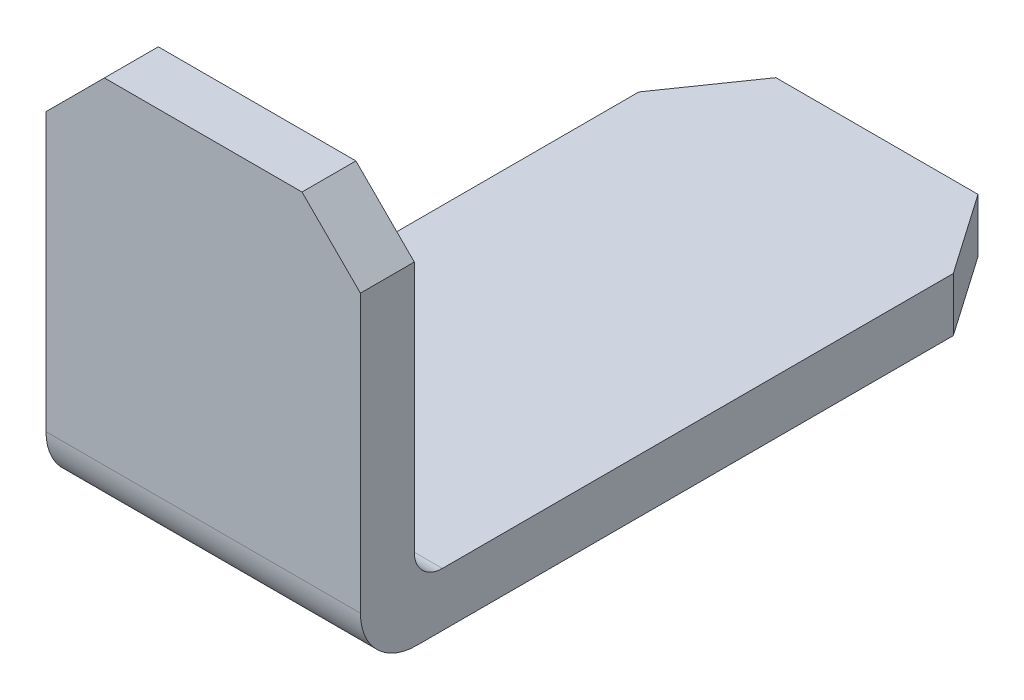
ISO-10303-21;
HEADER;
FILE_DESCRIPTION(('STEP AP214'),'2;1');
FILE_NAME('part.step','',(''),(''),'','','');
FILE_SCHEMA(('AUTOMOTIVE_DESIGN { 1 0 10303 214 1 1 1 1 }'));
ENDSEC;
DATA;
#1=APPLICATION_CONTEXT('core data for automotive mechanical design processes');
#2=APPLICATION_PROTOCOL_DEFINITION('international standard','automotive_design',2000,#1);
#3=PRODUCT_CONTEXT('',#1,'mechanical');
#4=PRODUCT('Part','Part','',(#3));
#5=PRODUCT_RELATED_PRODUCT_CATEGORY('part','',(#4));
#6=PRODUCT_DEFINITION_FORMATION('','',#4);
#7=PRODUCT_DEFINITION_CONTEXT('part definition',#1,'design');
#8=PRODUCT_DEFINITION('design','',#6,#7);
#9=PRODUCT_DEFINITION_SHAPE('','',#8);
#10=(LENGTH_UNIT() NAMED_UNIT(*) SI_UNIT(.MILLI.,.METRE.));
#11=(NAMED_UNIT(*) PLANE_ANGLE_UNIT() SI_UNIT($,.RADIAN.));
#12=(NAMED_UNIT(*) SI_UNIT($,.STERADIAN.) SOLID_ANGLE_UNIT());
#13=UNCERTAINTY_MEASURE_WITH_UNIT(LENGTH_MEASURE(1.E-05),#10,'distance_accuracy_value','');
#14=(GEOMETRIC_REPRESENTATION_CONTEXT(3) GLOBAL_UNCERTAINTY_ASSIGNED_CONTEXT((#13)) GLOBAL_UNIT_ASSIGNED_CONTEXT((#10,
#11,#12)) REPRESENTATION_CONTEXT('',''));
#15=CARTESIAN_POINT('',(0.,0.,0.));
#16=DIRECTION('',(0.,0.,1.));
#17=DIRECTION('',(1.,0.,0.));
#18=AXIS2_PLACEMENT_3D('',#15,#16,#17);
#19=CARTESIAN_POINT('',(-1.77635683940025E-13,-14.0158679848659,-14.9606000000013));
#20=DIRECTION('',(0.,1.,0.));
#21=DIRECTION('',(-1.,0.,0.));
#22=AXIS2_PLACEMENT_3D('',#19,#20,#21);
#23=PLANE('',#22);
#24=DIRECTION('',(0.,0.,1.));
#25=VECTOR('',#24,1.);
#26=CARTESIAN_POINT('',(1.3969999999999,-14.0158679848658,-15.5956000000031));
#27=LINE('',#26,#25);
#28=CARTESIAN_POINT('',(1.39699999999985,-14.0158679848659,-14.9606000000024));
#29=VERTEX_POINT('',#28);
#30=CARTESIAN_POINT('',(1.39699999999985,-14.0158679848659,-15.7226000000013));
#31=VERTEX_POINT('',#30);
#32=EDGE_CURVE('E239',#29,#31,#27,.F.);
#33=ORIENTED_EDGE('',*,*,#32,.T.);
#34=DIRECTION('',(-1.,0.,0.));
#35=VECTOR('',#34,1.);
#36=CARTESIAN_POINT('',(-1.77635683940025E-13,-14.0158679848659,-15.7226000000013));
#37=LINE('',#36,#35);
#38=CARTESIAN_POINT('',(-1.39700000000035,-14.0158679848657,-15.7226000000012));
#39=VERTEX_POINT('',#38);
#40=EDGE_CURVE('E224',#39,#31,#37,.F.);
#41=ORIENTED_EDGE('',*,*,#40,.F.);
#42=DIRECTION('',(0.,0.,1.));
#43=VECTOR('',#42,1.);
#44=CARTESIAN_POINT('',(-1.39700000000044,-14.0158679848656,-15.5956000000031));
#45=LINE('',#44,#43);
#46=CARTESIAN_POINT('',(-1.39700000000026,-14.0158679848658,-14.9606000000024));
#47=VERTEX_POINT('',#46);
#48=EDGE_CURVE('E209',#39,#47,#45,.T.);
#49=ORIENTED_EDGE('',*,*,#48,.T.);
#50=DIRECTION('',(-1.,0.,0.));
#51=VECTOR('',#50,1.);
#52=CARTESIAN_POINT('',(-3.73034936274053E-13,-14.0158679848659,-14.9606000000024));
#53=LINE('',#52,#51);
#54=EDGE_CURVE('E216',#47,#29,#53,.F.);
#55=ORIENTED_EDGE('',*,*,#54,.T.);
#56=EDGE_LOOP('',(#33,#41,#49,#55));
#57=FACE_BOUND('',#56,.T.);
#58=ADVANCED_FACE('F17',(#57),#23,.T.);
#59=CARTESIAN_POINT('',(-1.77635683940025E-13,-18.3941929848659,-16.1194750000013));
#60=DIRECTION('',(1.,0.,0.));
#61=DIRECTION('',(0.,0.,-1.));
#62=AXIS2_PLACEMENT_3D('',#59,#60,#61);
#63=CYLINDRICAL_SURFACE('',#62,0.396875);
#64=DIRECTION('',(-1.,0.,0.));
#65=VECTOR('',#64,1.);
#66=CARTESIAN_POINT('',(-1.95399252334028E-13,-18.7910679848659,-16.1194750000013));
#67=LINE('',#66,#65);
#68=CARTESIAN_POINT('',(-2.22250000000018,-18.7910679848657,-16.1194750000013));
#69=VERTEX_POINT('',#68);
#70=CARTESIAN_POINT('',(2.22249999999981,-18.7910679848657,-16.1194750000013));
#71=VERTEX_POINT('',#70);
#72=EDGE_CURVE('E118',#69,#71,#67,.F.);
#73=ORIENTED_EDGE('',*,*,#72,.F.);
#74=CARTESIAN_POINT('',(-2.22250000000018,-18.3941929848659,-16.1194750000013));
#75=DIRECTION('',(1.,0.,0.));
#76=DIRECTION('',(0.,0.,-1.));
#77=AXIS2_PLACEMENT_3D('',#74,#75,#76);
#78=CIRCLE('',#77,0.396875);
#79=CARTESIAN_POINT('',(-2.22250000000018,-18.3941929848659,-15.7226000000013));
#80=VERTEX_POINT('',#79);
#81=EDGE_CURVE('E20',#80,#69,#78,.T.);
#82=ORIENTED_EDGE('',*,*,#81,.F.);
#83=DIRECTION('',(-1.,0.,0.));
#84=VECTOR('',#83,1.);
#85=CARTESIAN_POINT('',(-1.77635683940025E-13,-18.3941929848659,-15.7226000000013));
#86=LINE('',#85,#84);
#87=CARTESIAN_POINT('',(2.22249999999981,-18.3941929848659,-15.7226000000013));
#88=VERTEX_POINT('',#87);
#89=EDGE_CURVE('E210',#88,#80,#86,.T.);
#90=ORIENTED_EDGE('',*,*,#89,.F.);
#91=CARTESIAN_POINT('',(2.22249999999981,-18.3941929848659,-16.1194750000013));
#92=DIRECTION('',(1.,0.,0.));
#93=DIRECTION('',(0.,0.,-1.));
#94=AXIS2_PLACEMENT_3D('',#91,#92,#93);
#95=CIRCLE('',#94,0.396875);
#96=EDGE_CURVE('E116',#71,#88,#95,.F.);
#97=ORIENTED_EDGE('',*,*,#96,.F.);
#98=EDGE_LOOP('',(#73,#82,#90,#97));
#99=FACE_BOUND('',#98,.T.);
#100=ADVANCED_FACE('F119',(#99),#63,.F.);
#101=CARTESIAN_POINT('',(-0.08320286726482,-12.5356651176011,-15.5956000000031));
#102=DIRECTION('',(-0.707106781186548,-0.707106781186547,0.));
#103=DIRECTION('',(0.707106781186547,-0.707106781186548,0.));
#104=AXIS2_PLACEMENT_3D('',#101,#102,#103);
#105=PLANE('',#104);
#106=DIRECTION('',(0.707106781186509,-0.707106781186586,0.));
#107=VECTOR('',#106,1.);
#108=CARTESIAN_POINT('',(1.39699999999982,-14.0158679848659,-15.7226000000013));
#109=LINE('',#108,#107);
#110=CARTESIAN_POINT('',(2.22249999999982,-14.841367984866,-15.7226000000013));
#111=VERTEX_POINT('',#110);
#112=EDGE_CURVE('E213',#31,#111,#109,.T.);
#113=ORIENTED_EDGE('',*,*,#112,.F.);
#114=ORIENTED_EDGE('',*,*,#32,.F.);
#115=DIRECTION('',(0.707106781186509,-0.707106781186586,0.));
#116=VECTOR('',#115,1.);
#117=CARTESIAN_POINT('',(1.39699999999982,-14.0158679848659,-14.9606000000024));
#118=LINE('',#117,#116);
#119=CARTESIAN_POINT('',(2.22249999999981,-14.841367984866,-14.9606000000017));
#120=VERTEX_POINT('',#119);
#121=EDGE_CURVE('E199',#29,#120,#118,.T.);
#122=ORIENTED_EDGE('',*,*,#121,.T.);
#123=DIRECTION('',(0.,0.,-1.));
#124=VECTOR('',#123,1.);
#125=CARTESIAN_POINT('',(2.22249999999981,-14.841367984866,-18.3903055278142));
#126=LINE('',#125,#124);
#127=EDGE_CURVE('E167',#111,#120,#126,.F.);
#128=ORIENTED_EDGE('',*,*,#127,.F.);
#129=EDGE_LOOP('',(#113,#114,#122,#128));
#130=FACE_BOUND('',#129,.T.);
#131=ADVANCED_FACE('F259',(#130),#105,.F.);
#132=CARTESIAN_POINT('',(-1.77635683940025E-13,-14.0158679848659,-15.7226000000013));
#133=DIRECTION('',(0.,0.,-1.));
#134=DIRECTION('',(-1.,0.,0.));
#135=AXIS2_PLACEMENT_3D('',#132,#133,#134);
#136=PLANE('',#135);
#137=ORIENTED_EDGE('',*,*,#89,.T.);
#138=DIRECTION('',(0.,1.,0.));
#139=VECTOR('',#138,1.);
#140=CARTESIAN_POINT('',(-2.22250000000018,-18.1516700134505,-15.7226000000013));
#141=LINE('',#140,#139);
#142=CARTESIAN_POINT('',(-2.22250000000027,-14.8413679848658,-15.7226000000013));
#143=VERTEX_POINT('',#142);
#144=EDGE_CURVE('E115',#80,#143,#141,.T.);
#145=ORIENTED_EDGE('',*,*,#144,.T.);
#146=DIRECTION('',(0.707106781186547,0.707106781186548,0.));
#147=VECTOR('',#146,1.);
#148=CARTESIAN_POINT('',(-2.5905663418164,-15.2094343266816,-15.7226000000012));
#149=LINE('',#148,#147);
#150=EDGE_CURVE('E206',#143,#39,#149,.T.);
#151=ORIENTED_EDGE('',*,*,#150,.T.);
#152=ORIENTED_EDGE('',*,*,#40,.T.);
#153=ORIENTED_EDGE('',*,*,#112,.T.);
#154=DIRECTION('',(0.,1.,0.));
#155=VECTOR('',#154,1.);
#156=CARTESIAN_POINT('',(2.22249999999981,-18.1516700134505,-15.7226000000013));
#157=LINE('',#156,#155);
#158=EDGE_CURVE('E170',#88,#111,#157,.T.);
#159=ORIENTED_EDGE('',*,*,#158,.F.);
#160=EDGE_LOOP('',(#137,#145,#151,#152,#153,#159));
#161=FACE_BOUND('',#160,.T.);
#162=ADVANCED_FACE('F254',(#161),#136,.T.);
#163=CARTESIAN_POINT('',(-2.5905663418164,-15.2094343266816,-15.5956000000031));
#164=DIRECTION('',(0.707106781186548,-0.707106781186547,0.));
#165=DIRECTION('',(0.707106781186547,0.707106781186548,0.));
#166=AXIS2_PLACEMENT_3D('',#163,#164,#165);
#167=PLANE('',#166);
#168=DIRECTION('',(0.707106781186547,0.707106781186548,0.));
#169=VECTOR('',#168,1.);
#170=CARTESIAN_POINT('',(-2.22250000000017,-14.8413679848659,-14.9606000000024));
#171=LINE('',#170,#169);
#172=CARTESIAN_POINT('',(-2.22250000000018,-14.8413679848659,-14.9606000000016));
#173=VERTEX_POINT('',#172);
#174=EDGE_CURVE('E124',#173,#47,#171,.T.);
#175=ORIENTED_EDGE('',*,*,#174,.T.);
#176=ORIENTED_EDGE('',*,*,#48,.F.);
#177=ORIENTED_EDGE('',*,*,#150,.F.);
#178=DIRECTION('',(0.,0.,-1.));
#179=VECTOR('',#178,1.);
#180=CARTESIAN_POINT('',(-2.22250000000018,-14.8413679848659,-18.3903055278141));
#181=LINE('',#180,#179);
#182=EDGE_CURVE('E131',#143,#173,#181,.F.);
#183=ORIENTED_EDGE('',*,*,#182,.T.);
#184=EDGE_LOOP('',(#175,#176,#177,#183));
#185=FACE_BOUND('',#184,.T.);
#186=ADVANCED_FACE('F286',(#185),#167,.F.);
#187=CARTESIAN_POINT('',(-3.73034936274053E-13,8.34887714518118E-13,-14.9606000000024));
#188=DIRECTION('',(0.,0.,-1.));
#189=DIRECTION('',(-1.,0.,0.));
#190=AXIS2_PLACEMENT_3D('',#187,#188,#189);
#191=PLANE('',#190);
#192=DIRECTION('',(0.,1.,0.));
#193=VECTOR('',#192,1.);
#194=CARTESIAN_POINT('',(-2.22250000000018,-18.1516700134505,-14.9606000000012));
#195=LINE('',#194,#193);
#196=CARTESIAN_POINT('',(-2.22250000000018,-18.759317984866,-14.9606000000013));
#197=VERTEX_POINT('',#196);
#198=EDGE_CURVE('E203',#173,#197,#195,.F.);
#199=ORIENTED_EDGE('',*,*,#198,.T.);
#200=DIRECTION('',(1.,0.,0.));
#201=VECTOR('',#200,1.);
#202=CARTESIAN_POINT('',(-1.95575500239187E-13,-18.759317984866,-14.9606000000013));
#203=LINE('',#202,#201);
#204=CARTESIAN_POINT('',(2.22249999999981,-18.759317984866,-14.9606000000013));
#205=VERTEX_POINT('',#204);
#206=EDGE_CURVE('E129',#205,#197,#203,.F.);
#207=ORIENTED_EDGE('',*,*,#206,.F.);
#208=DIRECTION('',(0.,1.,0.));
#209=VECTOR('',#208,1.);
#210=CARTESIAN_POINT('',(2.22249999999981,-18.1516700134505,-14.9606000000013));
#211=LINE('',#210,#209);
#212=EDGE_CURVE('E165',#120,#205,#211,.F.);
#213=ORIENTED_EDGE('',*,*,#212,.F.);
#214=ORIENTED_EDGE('',*,*,#121,.F.);
#215=ORIENTED_EDGE('',*,*,#54,.F.);
#216=ORIENTED_EDGE('',*,*,#174,.F.);
#217=EDGE_LOOP('',(#199,#207,#213,#214,#215,#216));
#218=FACE_BOUND('',#217,.T.);
#219=ADVANCED_FACE('F265',(#218),#191,.F.);
#220=CARTESIAN_POINT('',(-1.95399252334028E-13,-18.7910679848659,-16.1194750000013));
#221=DIRECTION('',(0.,1.,0.));
#222=DIRECTION('',(-1.,0.,0.));
#223=AXIS2_PLACEMENT_3D('',#220,#221,#222);
#224=PLANE('',#223);
#225=DIRECTION('',(-1.,0.,0.));
#226=VECTOR('',#225,1.);
#227=CARTESIAN_POINT('',(-3.5527136788005E-13,-18.7910679848655,-24.4856000000025));
#228=LINE('',#227,#226);
#229=CARTESIAN_POINT('',(-1.42875000000038,-18.7910679848655,-24.4856000000026));
#230=VERTEX_POINT('',#229);
#231=CARTESIAN_POINT('',(1.42874999999965,-18.7910679848657,-24.4856000000025));
#232=VERTEX_POINT('',#231);
#233=EDGE_CURVE('E189',#230,#232,#228,.F.);
#234=ORIENTED_EDGE('',*,*,#233,.F.);
#235=DIRECTION('',(-0.570395809495344,0.,0.821369965673296));
#236=VECTOR('',#235,1.);
#237=CARTESIAN_POINT('',(-1.82562500000035,-18.7910679848655,-23.9141000000026));
#238=LINE('',#237,#236);
#239=CARTESIAN_POINT('',(-2.22250000000028,-18.7910679848655,-23.3426000000026));
#240=VERTEX_POINT('',#239);
#241=EDGE_CURVE('E128',#240,#230,#238,.F.);
#242=ORIENTED_EDGE('',*,*,#241,.F.);
#243=DIRECTION('',(0.,0.,-1.));
#244=VECTOR('',#243,1.);
#245=CARTESIAN_POINT('',(-2.22250000000018,-18.7910679848655,-18.3903055278141));
#246=LINE('',#245,#244);
#247=EDGE_CURVE('E112',#240,#69,#246,.F.);
#248=ORIENTED_EDGE('',*,*,#247,.T.);
#249=ORIENTED_EDGE('',*,*,#72,.T.);
#250=DIRECTION('',(0.,0.,-1.));
#251=VECTOR('',#250,1.);
#252=CARTESIAN_POINT('',(2.22249999999981,-18.7910679848655,-18.3903055278142));
#253=LINE('',#252,#251);
#254=CARTESIAN_POINT('',(2.22249999999975,-18.7910679848656,-23.3426000000025));
#255=VERTEX_POINT('',#254);
#256=EDGE_CURVE('E173',#255,#71,#253,.F.);
#257=ORIENTED_EDGE('',*,*,#256,.F.);
#258=DIRECTION('',(-0.570395809495346,0.,-0.821369965673294));
#259=VECTOR('',#258,1.);
#260=CARTESIAN_POINT('',(2.22249999999965,-18.7910679848659,-23.3426000000026));
#261=LINE('',#260,#259);
#262=EDGE_CURVE('E123',#255,#232,#261,.T.);
#263=ORIENTED_EDGE('',*,*,#262,.T.);
#264=EDGE_LOOP('',(#234,#242,#248,#249,#257,#263));
#265=FACE_BOUND('',#264,.T.);
#266=ADVANCED_FACE('F127',(#265),#224,.T.);
#267=CARTESIAN_POINT('',(2.22249999999981,-18.1516700134505,-18.3903055278142));
#268=DIRECTION('',(1.,0.,0.));
#269=DIRECTION('',(0.,0.,-1.));
#270=AXIS2_PLACEMENT_3D('',#267,#268,#269);
#271=PLANE('',#270);
#272=DIRECTION('',(0.,0.,1.));
#273=VECTOR('',#272,1.);
#274=CARTESIAN_POINT('',(2.22249999999965,-19.5530679848659,-24.4856000000013));
#275=LINE('',#274,#273);
#276=CARTESIAN_POINT('',(2.22249999999965,-19.5530679848659,-23.3426000000026));
#277=VERTEX_POINT('',#276);
#278=CARTESIAN_POINT('',(2.22249999999973,-19.5530679848659,-15.7543500000013));
#279=VERTEX_POINT('',#278);
#280=EDGE_CURVE('E145',#277,#279,#275,.T.);
#281=ORIENTED_EDGE('',*,*,#280,.F.);
#282=DIRECTION('',(0.,1.,0.));
#283=VECTOR('',#282,1.);
#284=CARTESIAN_POINT('',(2.22249999999964,-18.4713689991577,-23.3426000000026));
#285=LINE('',#284,#283);
#286=EDGE_CURVE('E162',#255,#277,#285,.F.);
#287=ORIENTED_EDGE('',*,*,#286,.F.);
#288=ORIENTED_EDGE('',*,*,#256,.T.);
#289=ORIENTED_EDGE('',*,*,#96,.T.);
#290=ORIENTED_EDGE('',*,*,#158,.T.);
#291=ORIENTED_EDGE('',*,*,#127,.T.);
#292=ORIENTED_EDGE('',*,*,#212,.T.);
#293=CARTESIAN_POINT('',(2.22249999999981,-18.7593179848659,-15.7543500000013));
#294=DIRECTION('',(1.,0.,0.));
#295=DIRECTION('',(0.,0.,-1.));
#296=AXIS2_PLACEMENT_3D('',#293,#294,#295);
#297=CIRCLE('',#296,0.79375);
#298=EDGE_CURVE('E134',#279,#205,#297,.F.);
#299=ORIENTED_EDGE('',*,*,#298,.F.);
#300=EDGE_LOOP('',(#281,#287,#288,#289,#290,#291,#292,#299));
#301=FACE_BOUND('',#300,.T.);
#302=ADVANCED_FACE('F250',(#301),#271,.T.);
#303=CARTESIAN_POINT('',(-1.95399252334028E-13,-18.7593179848659,-15.7543500000013));
#304=DIRECTION('',(1.,0.,0.));
#305=DIRECTION('',(0.,0.,-1.));
#306=AXIS2_PLACEMENT_3D('',#303,#304,#305);
#307=CYLINDRICAL_SURFACE('',#306,0.79375);
#308=CARTESIAN_POINT('',(-2.22250000000018,-18.7593179848659,-15.7543500000013));
#309=DIRECTION('',(1.,0.,0.));
#310=DIRECTION('',(0.,0.,-1.));
#311=AXIS2_PLACEMENT_3D('',#308,#309,#310);
#312=CIRCLE('',#311,0.79375);
#313=CARTESIAN_POINT('',(-2.22250000000018,-19.5530679848659,-15.7543500000013));
#314=VERTEX_POINT('',#313);
#315=EDGE_CURVE('E186',#197,#314,#312,.T.);
#316=ORIENTED_EDGE('',*,*,#315,.T.);
#317=DIRECTION('',(1.,0.,0.));
#318=VECTOR('',#317,1.);
#319=CARTESIAN_POINT('',(-1.77635683940025E-13,-19.5530679848659,-15.7543500000013));
#320=LINE('',#319,#318);
#321=EDGE_CURVE('E141',#279,#314,#320,.F.);
#322=ORIENTED_EDGE('',*,*,#321,.F.);
#323=ORIENTED_EDGE('',*,*,#298,.T.);
#324=ORIENTED_EDGE('',*,*,#206,.T.);
#325=EDGE_LOOP('',(#316,#322,#323,#324));
#326=FACE_BOUND('',#325,.T.);
#327=ADVANCED_FACE('F269',(#326),#307,.T.);
#328=CARTESIAN_POINT('',(-2.22250000000018,-18.1516700134505,-18.3903055278141));
#329=DIRECTION('',(1.,0.,0.));
#330=DIRECTION('',(0.,0.,-1.));
#331=AXIS2_PLACEMENT_3D('',#328,#329,#330);
#332=PLANE('',#331);
#333=ORIENTED_EDGE('',*,*,#315,.F.);
#334=ORIENTED_EDGE('',*,*,#198,.F.);
#335=ORIENTED_EDGE('',*,*,#182,.F.);
#336=ORIENTED_EDGE('',*,*,#144,.F.);
#337=ORIENTED_EDGE('',*,*,#81,.T.);
#338=ORIENTED_EDGE('',*,*,#247,.F.);
#339=DIRECTION('',(0.,1.,0.));
#340=VECTOR('',#339,1.);
#341=CARTESIAN_POINT('',(-2.22250000000034,-18.4713689991578,-23.3426000000026));
#342=LINE('',#341,#340);
#343=CARTESIAN_POINT('',(-2.22250000000025,-19.5530679848659,-23.3426000000027));
#344=VERTEX_POINT('',#343);
#345=EDGE_CURVE('E155',#344,#240,#342,.T.);
#346=ORIENTED_EDGE('',*,*,#345,.F.);
#347=DIRECTION('',(0.,0.,1.));
#348=VECTOR('',#347,1.);
#349=CARTESIAN_POINT('',(-2.22250000000018,-19.5530679848659,-24.4856000000013));
#350=LINE('',#349,#348);
#351=EDGE_CURVE('E144',#314,#344,#350,.F.);
#352=ORIENTED_EDGE('',*,*,#351,.F.);
#353=EDGE_LOOP('',(#333,#334,#335,#336,#337,#338,#346,#352));
#354=FACE_BOUND('',#353,.T.);
#355=ADVANCED_FACE('F110',(#354),#332,.F.);
#356=CARTESIAN_POINT('',(-1.82562500000035,-18.4713689991578,-23.9141000000026));
#357=DIRECTION('',(-0.821369965673296,0.,-0.570395809495344));
#358=DIRECTION('',(-0.570395809495344,0.,0.821369965673296));
#359=AXIS2_PLACEMENT_3D('',#356,#357,#358);
#360=PLANE('',#359);
#361=DIRECTION('',(0.570395809495336,0.,-0.821369965673301));
#362=VECTOR('',#361,1.);
#363=CARTESIAN_POINT('',(-2.22250000000034,-19.5530679848659,-23.3426000000026));
#364=LINE('',#363,#362);
#365=CARTESIAN_POINT('',(-1.42875000000038,-19.5530679848656,-24.4856000000025));
#366=VERTEX_POINT('',#365);
#367=EDGE_CURVE('E148',#344,#366,#364,.T.);
#368=ORIENTED_EDGE('',*,*,#367,.F.);
#369=ORIENTED_EDGE('',*,*,#345,.T.);
#370=ORIENTED_EDGE('',*,*,#241,.T.);
#371=DIRECTION('',(0.,1.,0.));
#372=VECTOR('',#371,1.);
#373=CARTESIAN_POINT('',(-1.42875000000036,-18.7910679848655,-24.4856000000025));
#374=LINE('',#373,#372);
#375=EDGE_CURVE('E157',#366,#230,#374,.T.);
#376=ORIENTED_EDGE('',*,*,#375,.F.);
#377=EDGE_LOOP('',(#368,#369,#370,#376));
#378=FACE_BOUND('',#377,.T.);
#379=ADVANCED_FACE('F279',(#378),#360,.T.);
#380=CARTESIAN_POINT('',(-3.5527136788005E-13,-18.7910679848655,-24.4856000000025));
#381=DIRECTION('',(0.,0.,-1.));
#382=DIRECTION('',(-1.,0.,0.));
#383=AXIS2_PLACEMENT_3D('',#380,#381,#382);
#384=PLANE('',#383);
#385=ORIENTED_EDGE('',*,*,#375,.T.);
#386=ORIENTED_EDGE('',*,*,#233,.T.);
#387=DIRECTION('',(0.,1.,0.));
#388=VECTOR('',#387,1.);
#389=CARTESIAN_POINT('',(1.42874999999964,-18.4713689991577,-24.4856000000026));
#390=LINE('',#389,#388);
#391=CARTESIAN_POINT('',(1.42874999999965,-19.5530679848656,-24.4856000000025));
#392=VERTEX_POINT('',#391);
#393=EDGE_CURVE('E35',#392,#232,#390,.T.);
#394=ORIENTED_EDGE('',*,*,#393,.F.);
#395=DIRECTION('',(1.,0.,0.));
#396=VECTOR('',#395,1.);
#397=CARTESIAN_POINT('',(-1.77635683940025E-13,-19.5530679848659,-24.4856000000026));
#398=LINE('',#397,#396);
#399=EDGE_CURVE('E26',#366,#392,#398,.T.);
#400=ORIENTED_EDGE('',*,*,#399,.F.);
#401=EDGE_LOOP('',(#385,#386,#394,#400));
#402=FACE_BOUND('',#401,.T.);
#403=ADVANCED_FACE('F276',(#402),#384,.T.);
#404=CARTESIAN_POINT('',(1.82562499999964,-18.4713689991577,-23.9141000000026));
#405=DIRECTION('',(0.821369965673296,0.,-0.570395809495344));
#406=DIRECTION('',(-0.570395809495344,0.,-0.821369965673296));
#407=AXIS2_PLACEMENT_3D('',#404,#405,#406);
#408=PLANE('',#407);
#409=ORIENTED_EDGE('',*,*,#262,.F.);
#410=ORIENTED_EDGE('',*,*,#286,.T.);
#411=DIRECTION('',(0.570395809495346,0.,0.821369965673294));
#412=VECTOR('',#411,1.);
#413=CARTESIAN_POINT('',(1.42874999999965,-19.5530679848659,-24.4856000000026));
#414=LINE('',#413,#412);
#415=EDGE_CURVE('E11',#392,#277,#414,.T.);
#416=ORIENTED_EDGE('',*,*,#415,.F.);
#417=ORIENTED_EDGE('',*,*,#393,.T.);
#418=EDGE_LOOP('',(#409,#410,#416,#417));
#419=FACE_BOUND('',#418,.T.);
#420=ADVANCED_FACE('F275',(#419),#408,.T.);
#421=CARTESIAN_POINT('',(-1.77635683940025E-13,-19.5530679848659,-24.4856000000013));
#422=DIRECTION('',(0.,-1.,0.));
#423=DIRECTION('',(1.,0.,0.));
#424=AXIS2_PLACEMENT_3D('',#421,#422,#423);
#425=PLANE('',#424);
#426=ORIENTED_EDGE('',*,*,#399,.T.);
#427=ORIENTED_EDGE('',*,*,#415,.T.);
#428=ORIENTED_EDGE('',*,*,#280,.T.);
#429=ORIENTED_EDGE('',*,*,#321,.T.);
#430=ORIENTED_EDGE('',*,*,#351,.T.);
#431=ORIENTED_EDGE('',*,*,#367,.T.);
#432=EDGE_LOOP('',(#426,#427,#428,#429,#430,#431));
#433=FACE_BOUND('',#432,.T.);
#434=ADVANCED_FACE('F273',(#433),#425,.T.);
#435=CLOSED_SHELL('',(#58,#100,#131,#162,#186,#219,#266,#302,#327,#355,#379,#403,#420,#434));
#436=MANIFOLD_SOLID_BREP('B1',#435);
#437=ADVANCED_BREP_SHAPE_REPRESENTATION('',(#18,#436),#14);
#438=SHAPE_DEFINITION_REPRESENTATION(#9,#437);
ENDSEC;
END-ISO-10303-21;
